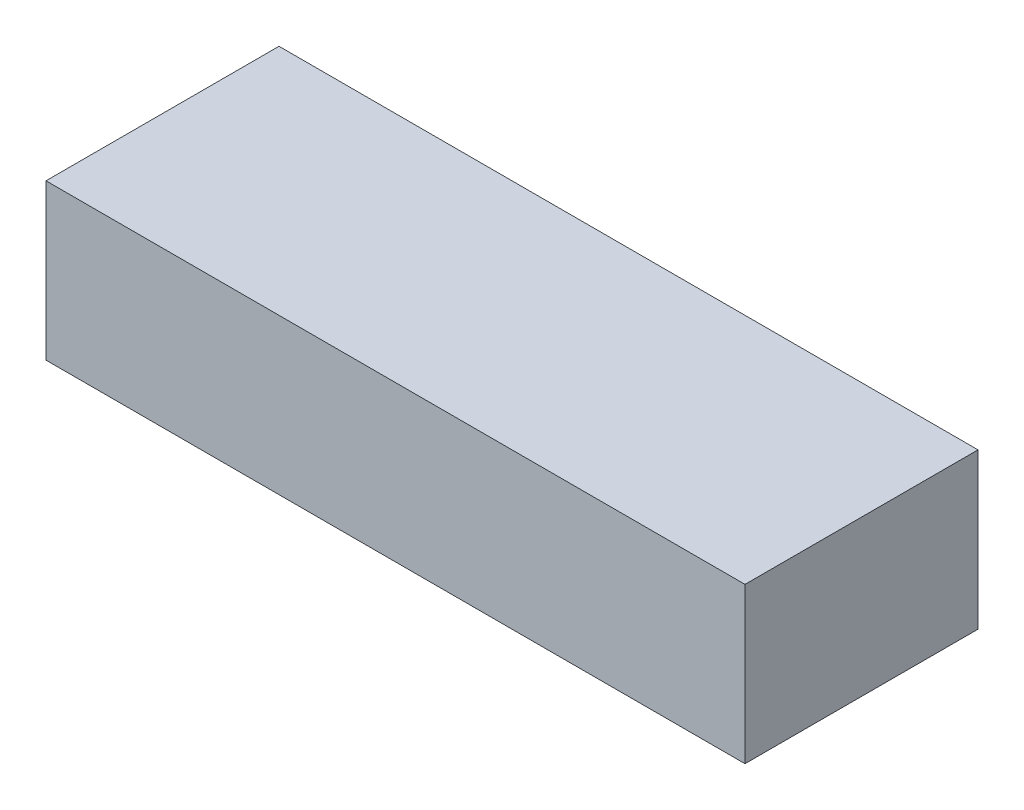
ISO-10303-21;
HEADER;
FILE_DESCRIPTION(('STEP AP214'),'2;1');
FILE_NAME('part.step','',(''),(''),'','','');
FILE_SCHEMA(('AUTOMOTIVE_DESIGN { 1 0 10303 214 1 1 1 1 }'));
ENDSEC;
DATA;
#1=APPLICATION_CONTEXT('core data for automotive mechanical design processes');
#2=APPLICATION_PROTOCOL_DEFINITION('international standard','automotive_design',2000,#1);
#3=PRODUCT_CONTEXT('',#1,'mechanical');
#4=PRODUCT('Part','Part','',(#3));
#5=PRODUCT_RELATED_PRODUCT_CATEGORY('part','',(#4));
#6=PRODUCT_DEFINITION_FORMATION('','',#4);
#7=PRODUCT_DEFINITION_CONTEXT('part definition',#1,'design');
#8=PRODUCT_DEFINITION('design','',#6,#7);
#9=PRODUCT_DEFINITION_SHAPE('','',#8);
#10=(LENGTH_UNIT() NAMED_UNIT(*) SI_UNIT(.MILLI.,.METRE.));
#11=(NAMED_UNIT(*) PLANE_ANGLE_UNIT() SI_UNIT($,.RADIAN.));
#12=(NAMED_UNIT(*) SI_UNIT($,.STERADIAN.) SOLID_ANGLE_UNIT());
#13=UNCERTAINTY_MEASURE_WITH_UNIT(LENGTH_MEASURE(1.E-05),#10,'distance_accuracy_value','');
#14=(GEOMETRIC_REPRESENTATION_CONTEXT(3) GLOBAL_UNCERTAINTY_ASSIGNED_CONTEXT((#13)) GLOBAL_UNIT_ASSIGNED_CONTEXT((#10,
#11,#12)) REPRESENTATION_CONTEXT('',''));
#15=CARTESIAN_POINT('',(0.,0.,0.));
#16=DIRECTION('',(0.,0.,1.));
#17=DIRECTION('',(1.,0.,0.));
#18=AXIS2_PLACEMENT_3D('',#15,#16,#17);
#19=CARTESIAN_POINT('',(0.,20.,0.));
#20=DIRECTION('',(1.,0.,0.));
#21=DIRECTION('',(0.,0.,-1.));
#22=AXIS2_PLACEMENT_3D('',#19,#20,#21);
#23=PLANE('',#22);
#24=DIRECTION('',(0.,0.,1.));
#25=VECTOR('',#24,1.);
#26=CARTESIAN_POINT('',(0.,0.,0.));
#27=LINE('',#26,#25);
#28=CARTESIAN_POINT('',(0.,0.,-30.));
#29=VERTEX_POINT('',#28);
#30=CARTESIAN_POINT('',(0.,0.,0.));
#31=VERTEX_POINT('',#30);
#32=EDGE_CURVE('E107',#29,#31,#27,.T.);
#33=ORIENTED_EDGE('',*,*,#32,.T.);
#34=DIRECTION('',(0.,-1.,0.));
#35=VECTOR('',#34,1.);
#36=CARTESIAN_POINT('',(0.,20.,0.));
#37=LINE('',#36,#35);
#38=CARTESIAN_POINT('',(0.,20.,0.));
#39=VERTEX_POINT('',#38);
#40=EDGE_CURVE('E11',#39,#31,#37,.T.);
#41=ORIENTED_EDGE('',*,*,#40,.F.);
#42=DIRECTION('',(0.,0.,1.));
#43=VECTOR('',#42,1.);
#44=CARTESIAN_POINT('',(0.,20.,0.));
#45=LINE('',#44,#43);
#46=CARTESIAN_POINT('',(0.,20.,-30.));
#47=VERTEX_POINT('',#46);
#48=EDGE_CURVE('E91',#47,#39,#45,.T.);
#49=ORIENTED_EDGE('',*,*,#48,.F.);
#50=DIRECTION('',(0.,-1.,0.));
#51=VECTOR('',#50,1.);
#52=CARTESIAN_POINT('',(0.,20.,-30.));
#53=LINE('',#52,#51);
#54=EDGE_CURVE('E103',#47,#29,#53,.T.);
#55=ORIENTED_EDGE('',*,*,#54,.T.);
#56=EDGE_LOOP('',(#33,#41,#49,#55));
#57=FACE_BOUND('',#56,.T.);
#58=ADVANCED_FACE('F39',(#57),#23,.F.);
#59=CARTESIAN_POINT('',(0.,20.,0.));
#60=DIRECTION('',(0.,0.,-1.));
#61=DIRECTION('',(-1.,0.,0.));
#62=AXIS2_PLACEMENT_3D('',#59,#60,#61);
#63=PLANE('',#62);
#64=DIRECTION('',(1.,0.,0.));
#65=VECTOR('',#64,1.);
#66=CARTESIAN_POINT('',(0.,0.,0.));
#67=LINE('',#66,#65);
#68=CARTESIAN_POINT('',(90.,0.,0.));
#69=VERTEX_POINT('',#68);
#70=EDGE_CURVE('E96',#31,#69,#67,.T.);
#71=ORIENTED_EDGE('',*,*,#70,.T.);
#72=DIRECTION('',(0.,-1.,0.));
#73=VECTOR('',#72,1.);
#74=CARTESIAN_POINT('',(90.,20.,0.));
#75=LINE('',#74,#73);
#76=CARTESIAN_POINT('',(90.,20.,0.));
#77=VERTEX_POINT('',#76);
#78=EDGE_CURVE('E48',#77,#69,#75,.T.);
#79=ORIENTED_EDGE('',*,*,#78,.F.);
#80=DIRECTION('',(1.,0.,0.));
#81=VECTOR('',#80,1.);
#82=CARTESIAN_POINT('',(0.,20.,0.));
#83=LINE('',#82,#81);
#84=EDGE_CURVE('E86',#39,#77,#83,.T.);
#85=ORIENTED_EDGE('',*,*,#84,.F.);
#86=ORIENTED_EDGE('',*,*,#40,.T.);
#87=EDGE_LOOP('',(#71,#79,#85,#86));
#88=FACE_BOUND('',#87,.T.);
#89=ADVANCED_FACE('F95',(#88),#63,.F.);
#90=CARTESIAN_POINT('',(90.,20.,0.));
#91=DIRECTION('',(-1.,0.,0.));
#92=DIRECTION('',(0.,0.,1.));
#93=AXIS2_PLACEMENT_3D('',#90,#91,#92);
#94=PLANE('',#93);
#95=DIRECTION('',(0.,0.,-1.));
#96=VECTOR('',#95,1.);
#97=CARTESIAN_POINT('',(90.,0.,0.));
#98=LINE('',#97,#96);
#99=CARTESIAN_POINT('',(90.,0.,-30.));
#100=VERTEX_POINT('',#99);
#101=EDGE_CURVE('E73',#69,#100,#98,.T.);
#102=ORIENTED_EDGE('',*,*,#101,.T.);
#103=DIRECTION('',(0.,-1.,0.));
#104=VECTOR('',#103,1.);
#105=CARTESIAN_POINT('',(90.,20.,-30.));
#106=LINE('',#105,#104);
#107=CARTESIAN_POINT('',(90.,20.,-30.));
#108=VERTEX_POINT('',#107);
#109=EDGE_CURVE('E98',#108,#100,#106,.T.);
#110=ORIENTED_EDGE('',*,*,#109,.F.);
#111=DIRECTION('',(0.,0.,-1.));
#112=VECTOR('',#111,1.);
#113=CARTESIAN_POINT('',(90.,20.,0.));
#114=LINE('',#113,#112);
#115=EDGE_CURVE('E89',#77,#108,#114,.T.);
#116=ORIENTED_EDGE('',*,*,#115,.F.);
#117=ORIENTED_EDGE('',*,*,#78,.T.);
#118=EDGE_LOOP('',(#102,#110,#116,#117));
#119=FACE_BOUND('',#118,.T.);
#120=ADVANCED_FACE('F99',(#119),#94,.F.);
#121=CARTESIAN_POINT('',(0.,20.,-30.));
#122=DIRECTION('',(0.,0.,1.));
#123=DIRECTION('',(1.,0.,0.));
#124=AXIS2_PLACEMENT_3D('',#121,#122,#123);
#125=PLANE('',#124);
#126=DIRECTION('',(-1.,0.,0.));
#127=VECTOR('',#126,1.);
#128=CARTESIAN_POINT('',(0.,0.,-30.));
#129=LINE('',#128,#127);
#130=EDGE_CURVE('E79',#100,#29,#129,.T.);
#131=ORIENTED_EDGE('',*,*,#130,.T.);
#132=ORIENTED_EDGE('',*,*,#54,.F.);
#133=DIRECTION('',(-1.,0.,0.));
#134=VECTOR('',#133,1.);
#135=CARTESIAN_POINT('',(0.,20.,-30.));
#136=LINE('',#135,#134);
#137=EDGE_CURVE('E56',#108,#47,#136,.T.);
#138=ORIENTED_EDGE('',*,*,#137,.F.);
#139=ORIENTED_EDGE('',*,*,#109,.T.);
#140=EDGE_LOOP('',(#131,#132,#138,#139));
#141=FACE_BOUND('',#140,.T.);
#142=ADVANCED_FACE('F120',(#141),#125,.F.);
#143=CARTESIAN_POINT('',(0.,20.,0.));
#144=DIRECTION('',(0.,-1.,0.));
#145=DIRECTION('',(0.,0.,-1.));
#146=AXIS2_PLACEMENT_3D('',#143,#144,#145);
#147=PLANE('',#146);
#148=ORIENTED_EDGE('',*,*,#48,.T.);
#149=ORIENTED_EDGE('',*,*,#84,.T.);
#150=ORIENTED_EDGE('',*,*,#115,.T.);
#151=ORIENTED_EDGE('',*,*,#137,.T.);
#152=EDGE_LOOP('',(#148,#149,#150,#151));
#153=FACE_BOUND('',#152,.T.);
#154=ADVANCED_FACE('F87',(#153),#147,.F.);
#155=CARTESIAN_POINT('',(0.,0.,0.));
#156=DIRECTION('',(0.,-1.,0.));
#157=DIRECTION('',(0.,0.,-1.));
#158=AXIS2_PLACEMENT_3D('',#155,#156,#157);
#159=PLANE('',#158);
#160=ORIENTED_EDGE('',*,*,#32,.F.);
#161=ORIENTED_EDGE('',*,*,#130,.F.);
#162=ORIENTED_EDGE('',*,*,#101,.F.);
#163=ORIENTED_EDGE('',*,*,#70,.F.);
#164=EDGE_LOOP('',(#160,#161,#162,#163));
#165=FACE_BOUND('',#164,.T.);
#166=ADVANCED_FACE('F123',(#165),#159,.T.);
#167=CLOSED_SHELL('',(#58,#89,#120,#142,#154,#166));
#168=MANIFOLD_SOLID_BREP('B2',#167);
#169=ADVANCED_BREP_SHAPE_REPRESENTATION('',(#18,#168),#14);
#170=SHAPE_DEFINITION_REPRESENTATION(#9,#169);
ENDSEC;
END-ISO-10303-21;
